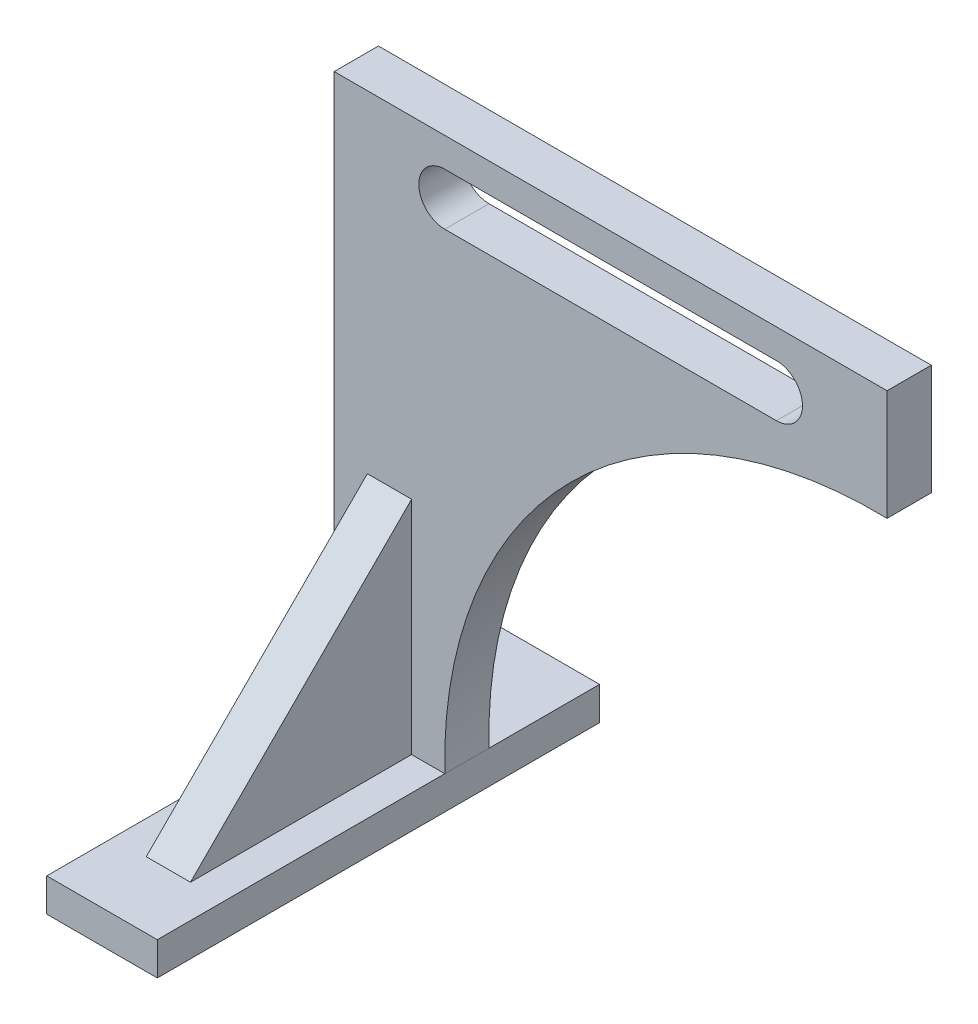
ISO-10303-21;
HEADER;
FILE_DESCRIPTION(('STEP AP214'),'2;1');
FILE_NAME('part.step','',(''),(''),'','','');
FILE_SCHEMA(('AUTOMOTIVE_DESIGN { 1 0 10303 214 1 1 1 1 }'));
ENDSEC;
DATA;
#1=APPLICATION_CONTEXT('core data for automotive mechanical design processes');
#2=APPLICATION_PROTOCOL_DEFINITION('international standard','automotive_design',2000,#1);
#3=PRODUCT_CONTEXT('',#1,'mechanical');
#4=PRODUCT('Part','Part','',(#3));
#5=PRODUCT_RELATED_PRODUCT_CATEGORY('part','',(#4));
#6=PRODUCT_DEFINITION_FORMATION('','',#4);
#7=PRODUCT_DEFINITION_CONTEXT('part definition',#1,'design');
#8=PRODUCT_DEFINITION('design','',#6,#7);
#9=PRODUCT_DEFINITION_SHAPE('','',#8);
#10=(LENGTH_UNIT() NAMED_UNIT(*) SI_UNIT(.MILLI.,.METRE.));
#11=(NAMED_UNIT(*) PLANE_ANGLE_UNIT() SI_UNIT($,.RADIAN.));
#12=(NAMED_UNIT(*) SI_UNIT($,.STERADIAN.) SOLID_ANGLE_UNIT());
#13=UNCERTAINTY_MEASURE_WITH_UNIT(LENGTH_MEASURE(1.E-05),#10,'distance_accuracy_value','');
#14=(GEOMETRIC_REPRESENTATION_CONTEXT(3) GLOBAL_UNCERTAINTY_ASSIGNED_CONTEXT((#13)) GLOBAL_UNIT_ASSIGNED_CONTEXT((#10,
#11,#12)) REPRESENTATION_CONTEXT('',''));
#15=CARTESIAN_POINT('',(0.,0.,0.));
#16=DIRECTION('',(0.,0.,1.));
#17=DIRECTION('',(1.,0.,0.));
#18=AXIS2_PLACEMENT_3D('',#15,#16,#17);
#19=CARTESIAN_POINT('',(0.,15.,0.));
#20=DIRECTION('',(0.,1.,0.));
#21=DIRECTION('',(0.,0.,1.));
#22=AXIS2_PLACEMENT_3D('',#19,#20,#21);
#23=PLANE('',#22);
#24=DIRECTION('',(0.,0.,1.));
#25=VECTOR('',#24,1.);
#26=CARTESIAN_POINT('',(-25.,15.,-100.));
#27=LINE('',#26,#25);
#28=CARTESIAN_POINT('',(-25.,15.,-100.));
#29=VERTEX_POINT('',#28);
#30=CARTESIAN_POINT('',(-25.,15.,-50.));
#31=VERTEX_POINT('',#30);
#32=EDGE_CURVE('E229',#29,#31,#27,.T.);
#33=ORIENTED_EDGE('',*,*,#32,.T.);
#34=DIRECTION('',(1.,0.,0.));
#35=VECTOR('',#34,1.);
#36=CARTESIAN_POINT('',(-25.,15.,-50.));
#37=LINE('',#36,#35);
#38=CARTESIAN_POINT('',(25.,15.,-50.));
#39=VERTEX_POINT('',#38);
#40=EDGE_CURVE('E194',#31,#39,#37,.T.);
#41=ORIENTED_EDGE('',*,*,#40,.T.);
#42=DIRECTION('',(0.,0.,1.));
#43=VECTOR('',#42,1.);
#44=CARTESIAN_POINT('',(25.,15.,-100.));
#45=LINE('',#44,#43);
#46=CARTESIAN_POINT('',(25.,15.,-100.));
#47=VERTEX_POINT('',#46);
#48=EDGE_CURVE('E237',#47,#39,#45,.T.);
#49=ORIENTED_EDGE('',*,*,#48,.F.);
#50=DIRECTION('',(1.,0.,0.));
#51=VECTOR('',#50,1.);
#52=CARTESIAN_POINT('',(-25.,15.,-100.));
#53=LINE('',#52,#51);
#54=EDGE_CURVE('E240',#29,#47,#53,.T.);
#55=ORIENTED_EDGE('',*,*,#54,.F.);
#56=EDGE_LOOP('',(#33,#41,#49,#55));
#57=FACE_BOUND('',#56,.T.);
#58=ADVANCED_FACE('F32',(#57),#23,.T.);
#59=CARTESIAN_POINT('',(-25.,15.,-100.));
#60=DIRECTION('',(1.,0.,0.));
#61=DIRECTION('',(0.,0.,-1.));
#62=AXIS2_PLACEMENT_3D('',#59,#60,#61);
#63=PLANE('',#62);
#64=DIRECTION('',(0.,0.,1.));
#65=VECTOR('',#64,1.);
#66=CARTESIAN_POINT('',(-25.,0.,-100.));
#67=LINE('',#66,#65);
#68=CARTESIAN_POINT('',(-25.,0.,-100.));
#69=VERTEX_POINT('',#68);
#70=CARTESIAN_POINT('',(-25.,0.,100.));
#71=VERTEX_POINT('',#70);
#72=EDGE_CURVE('E228',#69,#71,#67,.T.);
#73=ORIENTED_EDGE('',*,*,#72,.T.);
#74=DIRECTION('',(0.,-1.,0.));
#75=VECTOR('',#74,1.);
#76=CARTESIAN_POINT('',(-25.,15.,100.));
#77=LINE('',#76,#75);
#78=CARTESIAN_POINT('',(-25.,15.,100.));
#79=VERTEX_POINT('',#78);
#80=EDGE_CURVE('E260',#79,#71,#77,.T.);
#81=ORIENTED_EDGE('',*,*,#80,.F.);
#82=CARTESIAN_POINT('',(-25.,15.,-30.));
#83=VERTEX_POINT('',#82);
#84=EDGE_CURVE('E233',#83,#79,#27,.T.);
#85=ORIENTED_EDGE('',*,*,#84,.F.);
#86=DIRECTION('',(0.,-1.,0.));
#87=VECTOR('',#86,1.);
#88=CARTESIAN_POINT('',(-25.,15.,-30.));
#89=LINE('',#88,#87);
#90=CARTESIAN_POINT('',(-25.,265.,-30.));
#91=VERTEX_POINT('',#90);
#92=EDGE_CURVE('E205',#91,#83,#89,.T.);
#93=ORIENTED_EDGE('',*,*,#92,.F.);
#94=DIRECTION('',(0.,0.,-1.));
#95=VECTOR('',#94,1.);
#96=CARTESIAN_POINT('',(-25.,265.,-30.));
#97=LINE('',#96,#95);
#98=CARTESIAN_POINT('',(-25.,265.,-50.));
#99=VERTEX_POINT('',#98);
#100=EDGE_CURVE('E207',#91,#99,#97,.T.);
#101=ORIENTED_EDGE('',*,*,#100,.T.);
#102=DIRECTION('',(0.,-1.,0.));
#103=VECTOR('',#102,1.);
#104=CARTESIAN_POINT('',(-25.,15.,-50.));
#105=LINE('',#104,#103);
#106=EDGE_CURVE('E216',#99,#31,#105,.T.);
#107=ORIENTED_EDGE('',*,*,#106,.T.);
#108=ORIENTED_EDGE('',*,*,#32,.F.);
#109=DIRECTION('',(0.,-1.,0.));
#110=VECTOR('',#109,1.);
#111=CARTESIAN_POINT('',(-25.,15.,-100.));
#112=LINE('',#111,#110);
#113=EDGE_CURVE('E243',#29,#69,#112,.T.);
#114=ORIENTED_EDGE('',*,*,#113,.T.);
#115=EDGE_LOOP('',(#73,#81,#85,#93,#101,#107,#108,#114));
#116=FACE_BOUND('',#115,.T.);
#117=ADVANCED_FACE('F34',(#116),#63,.F.);
#118=CARTESIAN_POINT('',(-25.,15.,100.));
#119=DIRECTION('',(0.,0.,-1.));
#120=DIRECTION('',(-1.,0.,0.));
#121=AXIS2_PLACEMENT_3D('',#118,#119,#120);
#122=PLANE('',#121);
#123=DIRECTION('',(1.,0.,0.));
#124=VECTOR('',#123,1.);
#125=CARTESIAN_POINT('',(-25.,0.,100.));
#126=LINE('',#125,#124);
#127=CARTESIAN_POINT('',(25.,0.,100.));
#128=VERTEX_POINT('',#127);
#129=EDGE_CURVE('E246',#71,#128,#126,.T.);
#130=ORIENTED_EDGE('',*,*,#129,.T.);
#131=DIRECTION('',(0.,-1.,0.));
#132=VECTOR('',#131,1.);
#133=CARTESIAN_POINT('',(25.,15.,100.));
#134=LINE('',#133,#132);
#135=CARTESIAN_POINT('',(25.,15.,100.));
#136=VERTEX_POINT('',#135);
#137=EDGE_CURVE('E258',#136,#128,#134,.T.);
#138=ORIENTED_EDGE('',*,*,#137,.F.);
#139=DIRECTION('',(1.,0.,0.));
#140=VECTOR('',#139,1.);
#141=CARTESIAN_POINT('',(-25.,15.,100.));
#142=LINE('',#141,#140);
#143=EDGE_CURVE('E232',#79,#136,#142,.T.);
#144=ORIENTED_EDGE('',*,*,#143,.F.);
#145=ORIENTED_EDGE('',*,*,#80,.T.);
#146=EDGE_LOOP('',(#130,#138,#144,#145));
#147=FACE_BOUND('',#146,.T.);
#148=ADVANCED_FACE('F293',(#147),#122,.F.);
#149=CARTESIAN_POINT('',(25.,15.,-100.));
#150=DIRECTION('',(1.,0.,0.));
#151=DIRECTION('',(0.,0.,-1.));
#152=AXIS2_PLACEMENT_3D('',#149,#150,#151);
#153=PLANE('',#152);
#154=DIRECTION('',(0.,0.,1.));
#155=VECTOR('',#154,1.);
#156=CARTESIAN_POINT('',(25.,0.,-100.));
#157=LINE('',#156,#155);
#158=CARTESIAN_POINT('',(25.,0.,-100.));
#159=VERTEX_POINT('',#158);
#160=EDGE_CURVE('E249',#159,#128,#157,.T.);
#161=ORIENTED_EDGE('',*,*,#160,.F.);
#162=DIRECTION('',(0.,-1.,0.));
#163=VECTOR('',#162,1.);
#164=CARTESIAN_POINT('',(25.,15.,-100.));
#165=LINE('',#164,#163);
#166=EDGE_CURVE('E256',#47,#159,#165,.T.);
#167=ORIENTED_EDGE('',*,*,#166,.F.);
#168=ORIENTED_EDGE('',*,*,#48,.T.);
#169=DIRECTION('',(0.,0.,-1.));
#170=VECTOR('',#169,1.);
#171=CARTESIAN_POINT('',(25.,15.,-30.));
#172=LINE('',#171,#170);
#173=CARTESIAN_POINT('',(25.,15.,-30.));
#174=VERTEX_POINT('',#173);
#175=EDGE_CURVE('E226',#174,#39,#172,.T.);
#176=ORIENTED_EDGE('',*,*,#175,.F.);
#177=EDGE_CURVE('E236',#174,#136,#45,.T.);
#178=ORIENTED_EDGE('',*,*,#177,.T.);
#179=ORIENTED_EDGE('',*,*,#137,.T.);
#180=EDGE_LOOP('',(#161,#167,#168,#176,#178,#179));
#181=FACE_BOUND('',#180,.T.);
#182=ADVANCED_FACE('F307',(#181),#153,.T.);
#183=CARTESIAN_POINT('',(-25.,15.,-100.));
#184=DIRECTION('',(0.,0.,-1.));
#185=DIRECTION('',(-1.,0.,0.));
#186=AXIS2_PLACEMENT_3D('',#183,#184,#185);
#187=PLANE('',#186);
#188=DIRECTION('',(1.,0.,0.));
#189=VECTOR('',#188,1.);
#190=CARTESIAN_POINT('',(-25.,0.,-100.));
#191=LINE('',#190,#189);
#192=EDGE_CURVE('E252',#69,#159,#191,.T.);
#193=ORIENTED_EDGE('',*,*,#192,.F.);
#194=ORIENTED_EDGE('',*,*,#113,.F.);
#195=ORIENTED_EDGE('',*,*,#54,.T.);
#196=ORIENTED_EDGE('',*,*,#166,.T.);
#197=EDGE_LOOP('',(#193,#194,#195,#196));
#198=FACE_BOUND('',#197,.T.);
#199=ADVANCED_FACE('F299',(#198),#187,.T.);
#200=DIRECTION('',(0.,0.,-1.));
#201=VECTOR('',#200,1.);
#202=CARTESIAN_POINT('',(10.,15.,70.));
#203=LINE('',#202,#201);
#204=CARTESIAN_POINT('',(10.,15.,70.));
#205=VERTEX_POINT('',#204);
#206=CARTESIAN_POINT('',(10.,15.,-30.));
#207=VERTEX_POINT('',#206);
#208=EDGE_CURVE('E176',#205,#207,#203,.T.);
#209=ORIENTED_EDGE('',*,*,#208,.F.);
#210=DIRECTION('',(-1.,0.,0.));
#211=VECTOR('',#210,1.);
#212=CARTESIAN_POINT('',(10.,15.,70.));
#213=LINE('',#212,#211);
#214=CARTESIAN_POINT('',(-10.,15.,70.));
#215=VERTEX_POINT('',#214);
#216=EDGE_CURVE('E191',#205,#215,#213,.T.);
#217=ORIENTED_EDGE('',*,*,#216,.T.);
#218=DIRECTION('',(0.,0.,-1.));
#219=VECTOR('',#218,1.);
#220=CARTESIAN_POINT('',(-10.,15.,70.));
#221=LINE('',#220,#219);
#222=CARTESIAN_POINT('',(-10.,15.,-30.));
#223=VERTEX_POINT('',#222);
#224=EDGE_CURVE('E184',#215,#223,#221,.T.);
#225=ORIENTED_EDGE('',*,*,#224,.T.);
#226=DIRECTION('',(1.,0.,0.));
#227=VECTOR('',#226,1.);
#228=CARTESIAN_POINT('',(-25.,15.,-30.));
#229=LINE('',#228,#227);
#230=EDGE_CURVE('E195',#83,#223,#229,.T.);
#231=ORIENTED_EDGE('',*,*,#230,.F.);
#232=ORIENTED_EDGE('',*,*,#84,.T.);
#233=ORIENTED_EDGE('',*,*,#143,.T.);
#234=ORIENTED_EDGE('',*,*,#177,.F.);
#235=EDGE_CURVE('E199',#207,#174,#229,.T.);
#236=ORIENTED_EDGE('',*,*,#235,.F.);
#237=EDGE_LOOP('',(#209,#217,#225,#231,#232,#233,#234,#236));
#238=FACE_BOUND('',#237,.T.);
#239=ADVANCED_FACE('F289',(#238),#23,.T.);
#240=CARTESIAN_POINT('',(0.,0.,0.));
#241=DIRECTION('',(0.,1.,0.));
#242=DIRECTION('',(0.,0.,1.));
#243=AXIS2_PLACEMENT_3D('',#240,#241,#242);
#244=PLANE('',#243);
#245=ORIENTED_EDGE('',*,*,#72,.F.);
#246=ORIENTED_EDGE('',*,*,#192,.T.);
#247=ORIENTED_EDGE('',*,*,#160,.T.);
#248=ORIENTED_EDGE('',*,*,#129,.F.);
#249=EDGE_LOOP('',(#245,#246,#247,#248));
#250=FACE_BOUND('',#249,.T.);
#251=ADVANCED_FACE('F298',(#250),#244,.F.);
#252=CARTESIAN_POINT('',(220.242033787609,19.7579662123913,-30.));
#253=DIRECTION('',(0.,0.,-1.));
#254=DIRECTION('',(-1.,0.,0.));
#255=AXIS2_PLACEMENT_3D('',#252,#253,#254);
#256=CYLINDRICAL_SURFACE('',#255,195.3);
#257=CARTESIAN_POINT('',(220.242033787609,19.7579662123913,-50.));
#258=DIRECTION('',(0.,0.,-1.));
#259=DIRECTION('',(1.,0.,0.));
#260=AXIS2_PLACEMENT_3D('',#257,#258,#259);
#261=CIRCLE('',#260,195.3);
#262=CARTESIAN_POINT('',(225.,215.,-50.));
#263=VERTEX_POINT('',#262);
#264=EDGE_CURVE('E210',#39,#263,#261,.T.);
#265=ORIENTED_EDGE('',*,*,#264,.T.);
#266=DIRECTION('',(0.,0.,-1.));
#267=VECTOR('',#266,1.);
#268=CARTESIAN_POINT('',(225.,215.,-30.));
#269=LINE('',#268,#267);
#270=CARTESIAN_POINT('',(225.,215.,-30.));
#271=VERTEX_POINT('',#270);
#272=EDGE_CURVE('E223',#271,#263,#269,.T.);
#273=ORIENTED_EDGE('',*,*,#272,.F.);
#274=CARTESIAN_POINT('',(220.242033787609,19.7579662123913,-30.));
#275=DIRECTION('',(0.,0.,-1.));
#276=DIRECTION('',(1.,0.,0.));
#277=AXIS2_PLACEMENT_3D('',#274,#275,#276);
#278=CIRCLE('',#277,195.3);
#279=EDGE_CURVE('E198',#174,#271,#278,.T.);
#280=ORIENTED_EDGE('',*,*,#279,.F.);
#281=ORIENTED_EDGE('',*,*,#175,.T.);
#282=EDGE_LOOP('',(#265,#273,#280,#281));
#283=FACE_BOUND('',#282,.T.);
#284=ADVANCED_FACE('F305',(#283),#256,.F.);
#285=CARTESIAN_POINT('',(225.,265.,-30.));
#286=DIRECTION('',(-1.,0.,0.));
#287=DIRECTION('',(0.,-1.,0.));
#288=AXIS2_PLACEMENT_3D('',#285,#286,#287);
#289=PLANE('',#288);
#290=DIRECTION('',(0.,1.,0.));
#291=VECTOR('',#290,1.);
#292=CARTESIAN_POINT('',(225.,265.,-50.));
#293=LINE('',#292,#291);
#294=CARTESIAN_POINT('',(225.,265.,-50.));
#295=VERTEX_POINT('',#294);
#296=EDGE_CURVE('E212',#263,#295,#293,.T.);
#297=ORIENTED_EDGE('',*,*,#296,.T.);
#298=DIRECTION('',(0.,0.,-1.));
#299=VECTOR('',#298,1.);
#300=CARTESIAN_POINT('',(225.,265.,-30.));
#301=LINE('',#300,#299);
#302=CARTESIAN_POINT('',(225.,265.,-30.));
#303=VERTEX_POINT('',#302);
#304=EDGE_CURVE('E220',#303,#295,#301,.T.);
#305=ORIENTED_EDGE('',*,*,#304,.F.);
#306=DIRECTION('',(0.,1.,0.));
#307=VECTOR('',#306,1.);
#308=CARTESIAN_POINT('',(225.,265.,-30.));
#309=LINE('',#308,#307);
#310=EDGE_CURVE('E201',#271,#303,#309,.T.);
#311=ORIENTED_EDGE('',*,*,#310,.F.);
#312=ORIENTED_EDGE('',*,*,#272,.T.);
#313=EDGE_LOOP('',(#297,#305,#311,#312));
#314=FACE_BOUND('',#313,.T.);
#315=ADVANCED_FACE('F349',(#314),#289,.F.);
#316=CARTESIAN_POINT('',(-25.,265.,-30.));
#317=DIRECTION('',(0.,-1.,0.));
#318=DIRECTION('',(0.,0.,-1.));
#319=AXIS2_PLACEMENT_3D('',#316,#317,#318);
#320=PLANE('',#319);
#321=DIRECTION('',(-1.,0.,0.));
#322=VECTOR('',#321,1.);
#323=CARTESIAN_POINT('',(-25.,265.,-50.));
#324=LINE('',#323,#322);
#325=EDGE_CURVE('E214',#295,#99,#324,.T.);
#326=ORIENTED_EDGE('',*,*,#325,.T.);
#327=ORIENTED_EDGE('',*,*,#100,.F.);
#328=DIRECTION('',(-1.,0.,0.));
#329=VECTOR('',#328,1.);
#330=CARTESIAN_POINT('',(-25.,265.,-30.));
#331=LINE('',#330,#329);
#332=EDGE_CURVE('E203',#303,#91,#331,.T.);
#333=ORIENTED_EDGE('',*,*,#332,.F.);
#334=ORIENTED_EDGE('',*,*,#304,.T.);
#335=EDGE_LOOP('',(#326,#327,#333,#334));
#336=FACE_BOUND('',#335,.T.);
#337=ADVANCED_FACE('F345',(#336),#320,.F.);
#338=CARTESIAN_POINT('',(220.242033787609,19.7579662123913,-30.));
#339=DIRECTION('',(0.,0.,1.));
#340=DIRECTION('',(1.,0.,0.));
#341=AXIS2_PLACEMENT_3D('',#338,#339,#340);
#342=PLANE('',#341);
#343=CARTESIAN_POINT('',(25.,240.,-30.));
#344=DIRECTION('',(0.,0.,1.));
#345=DIRECTION('',(1.,0.,0.));
#346=AXIS2_PLACEMENT_3D('',#343,#344,#345);
#347=CIRCLE('',#346,11.75);
#348=CARTESIAN_POINT('',(25.,251.75,-30.));
#349=VERTEX_POINT('',#348);
#350=CARTESIAN_POINT('',(25.,228.25,-30.));
#351=VERTEX_POINT('',#350);
#352=EDGE_CURVE('E47',#349,#351,#347,.T.);
#353=ORIENTED_EDGE('',*,*,#352,.F.);
#354=DIRECTION('',(-1.,0.,0.));
#355=VECTOR('',#354,1.);
#356=CARTESIAN_POINT('',(25.,251.75,-30.));
#357=LINE('',#356,#355);
#358=CARTESIAN_POINT('',(175.,251.75,-30.));
#359=VERTEX_POINT('',#358);
#360=EDGE_CURVE('E164',#359,#349,#357,.T.);
#361=ORIENTED_EDGE('',*,*,#360,.F.);
#362=CARTESIAN_POINT('',(175.,240.,-30.));
#363=DIRECTION('',(0.,0.,1.));
#364=DIRECTION('',(1.,0.,0.));
#365=AXIS2_PLACEMENT_3D('',#362,#363,#364);
#366=CIRCLE('',#365,11.75);
#367=CARTESIAN_POINT('',(175.,228.25,-30.));
#368=VERTEX_POINT('',#367);
#369=EDGE_CURVE('E148',#368,#359,#366,.T.);
#370=ORIENTED_EDGE('',*,*,#369,.F.);
#371=DIRECTION('',(1.,0.,0.));
#372=VECTOR('',#371,1.);
#373=CARTESIAN_POINT('',(25.,228.25,-30.));
#374=LINE('',#373,#372);
#375=EDGE_CURVE('E157',#351,#368,#374,.T.);
#376=ORIENTED_EDGE('',*,*,#375,.F.);
#377=EDGE_LOOP('',(#353,#361,#370,#376));
#378=FACE_BOUND('',#377,.T.);
#379=DIRECTION('',(0.,1.,0.));
#380=VECTOR('',#379,1.);
#381=CARTESIAN_POINT('',(10.,15.,-30.));
#382=LINE('',#381,#380);
#383=CARTESIAN_POINT('',(10.,115.,-30.));
#384=VERTEX_POINT('',#383);
#385=EDGE_CURVE('E179',#207,#384,#382,.T.);
#386=ORIENTED_EDGE('',*,*,#385,.F.);
#387=ORIENTED_EDGE('',*,*,#235,.T.);
#388=ORIENTED_EDGE('',*,*,#279,.T.);
#389=ORIENTED_EDGE('',*,*,#310,.T.);
#390=ORIENTED_EDGE('',*,*,#332,.T.);
#391=ORIENTED_EDGE('',*,*,#92,.T.);
#392=ORIENTED_EDGE('',*,*,#230,.T.);
#393=DIRECTION('',(0.,1.,0.));
#394=VECTOR('',#393,1.);
#395=CARTESIAN_POINT('',(-10.,15.,-30.));
#396=LINE('',#395,#394);
#397=CARTESIAN_POINT('',(-10.,115.,-30.));
#398=VERTEX_POINT('',#397);
#399=EDGE_CURVE('E177',#223,#398,#396,.T.);
#400=ORIENTED_EDGE('',*,*,#399,.T.);
#401=DIRECTION('',(-1.,0.,0.));
#402=VECTOR('',#401,1.);
#403=CARTESIAN_POINT('',(10.,115.,-30.));
#404=LINE('',#403,#402);
#405=EDGE_CURVE('E181',#384,#398,#404,.T.);
#406=ORIENTED_EDGE('',*,*,#405,.F.);
#407=EDGE_LOOP('',(#386,#387,#388,#389,#390,#391,#392,#400,#406));
#408=FACE_BOUND('',#407,.T.);
#409=ADVANCED_FACE('F161',(#378,#408),#342,.T.);
#410=CARTESIAN_POINT('',(220.242033787609,19.7579662123913,-50.));
#411=DIRECTION('',(0.,0.,1.));
#412=DIRECTION('',(1.,0.,0.));
#413=AXIS2_PLACEMENT_3D('',#410,#411,#412);
#414=PLANE('',#413);
#415=DIRECTION('',(-1.,0.,0.));
#416=VECTOR('',#415,1.);
#417=CARTESIAN_POINT('',(220.242033787609,251.75,-50.));
#418=LINE('',#417,#416);
#419=CARTESIAN_POINT('',(175.,251.75,-50.));
#420=VERTEX_POINT('',#419);
#421=CARTESIAN_POINT('',(25.,251.75,-50.));
#422=VERTEX_POINT('',#421);
#423=EDGE_CURVE('E40',#420,#422,#418,.T.);
#424=ORIENTED_EDGE('',*,*,#423,.T.);
#425=CARTESIAN_POINT('',(25.,240.,-50.));
#426=DIRECTION('',(0.,0.,1.));
#427=DIRECTION('',(1.,0.,0.));
#428=AXIS2_PLACEMENT_3D('',#425,#426,#427);
#429=CIRCLE('',#428,11.75);
#430=CARTESIAN_POINT('',(25.,228.25,-50.));
#431=VERTEX_POINT('',#430);
#432=EDGE_CURVE('E11',#422,#431,#429,.T.);
#433=ORIENTED_EDGE('',*,*,#432,.T.);
#434=DIRECTION('',(1.,0.,0.));
#435=VECTOR('',#434,1.);
#436=CARTESIAN_POINT('',(220.242033787609,228.25,-50.));
#437=LINE('',#436,#435);
#438=CARTESIAN_POINT('',(175.,228.25,-50.));
#439=VERTEX_POINT('',#438);
#440=EDGE_CURVE('E263',#431,#439,#437,.T.);
#441=ORIENTED_EDGE('',*,*,#440,.T.);
#442=CARTESIAN_POINT('',(175.,240.,-50.));
#443=DIRECTION('',(0.,0.,1.));
#444=DIRECTION('',(1.,0.,0.));
#445=AXIS2_PLACEMENT_3D('',#442,#443,#444);
#446=CIRCLE('',#445,11.75);
#447=EDGE_CURVE('E151',#439,#420,#446,.T.);
#448=ORIENTED_EDGE('',*,*,#447,.T.);
#449=EDGE_LOOP('',(#424,#433,#441,#448));
#450=FACE_BOUND('',#449,.T.);
#451=ORIENTED_EDGE('',*,*,#40,.F.);
#452=ORIENTED_EDGE('',*,*,#106,.F.);
#453=ORIENTED_EDGE('',*,*,#325,.F.);
#454=ORIENTED_EDGE('',*,*,#296,.F.);
#455=ORIENTED_EDGE('',*,*,#264,.F.);
#456=EDGE_LOOP('',(#451,#452,#453,#454,#455));
#457=FACE_BOUND('',#456,.T.);
#458=ADVANCED_FACE('F267',(#450,#457),#414,.F.);
#459=CARTESIAN_POINT('',(10.,115.,-30.));
#460=DIRECTION('',(0.,-0.707106781186547,-0.707106781186548));
#461=DIRECTION('',(0.,0.707106781186548,-0.707106781186547));
#462=AXIS2_PLACEMENT_3D('',#459,#460,#461);
#463=PLANE('',#462);
#464=DIRECTION('',(0.,-0.707106781186548,0.707106781186547));
#465=VECTOR('',#464,1.);
#466=CARTESIAN_POINT('',(-10.,115.,-30.));
#467=LINE('',#466,#465);
#468=EDGE_CURVE('E171',#398,#215,#467,.T.);
#469=ORIENTED_EDGE('',*,*,#468,.T.);
#470=ORIENTED_EDGE('',*,*,#216,.F.);
#471=DIRECTION('',(0.,-0.707106781186548,0.707106781186547));
#472=VECTOR('',#471,1.);
#473=CARTESIAN_POINT('',(10.,115.,-30.));
#474=LINE('',#473,#472);
#475=EDGE_CURVE('E174',#384,#205,#474,.T.);
#476=ORIENTED_EDGE('',*,*,#475,.F.);
#477=ORIENTED_EDGE('',*,*,#405,.T.);
#478=EDGE_LOOP('',(#469,#470,#476,#477));
#479=FACE_BOUND('',#478,.T.);
#480=ADVANCED_FACE('F320',(#479),#463,.F.);
#481=CARTESIAN_POINT('',(10.,0.,0.));
#482=DIRECTION('',(1.,0.,0.));
#483=DIRECTION('',(0.,0.,-1.));
#484=AXIS2_PLACEMENT_3D('',#481,#482,#483);
#485=PLANE('',#484);
#486=ORIENTED_EDGE('',*,*,#475,.T.);
#487=ORIENTED_EDGE('',*,*,#208,.T.);
#488=ORIENTED_EDGE('',*,*,#385,.T.);
#489=EDGE_LOOP('',(#486,#487,#488));
#490=FACE_BOUND('',#489,.T.);
#491=ADVANCED_FACE('F281',(#490),#485,.T.);
#492=CARTESIAN_POINT('',(-10.,0.,0.));
#493=DIRECTION('',(1.,0.,0.));
#494=DIRECTION('',(0.,0.,-1.));
#495=AXIS2_PLACEMENT_3D('',#492,#493,#494);
#496=PLANE('',#495);
#497=ORIENTED_EDGE('',*,*,#468,.F.);
#498=ORIENTED_EDGE('',*,*,#399,.F.);
#499=ORIENTED_EDGE('',*,*,#224,.F.);
#500=EDGE_LOOP('',(#497,#498,#499));
#501=FACE_BOUND('',#500,.T.);
#502=ADVANCED_FACE('F274',(#501),#496,.F.);
#503=CARTESIAN_POINT('',(25.,240.,-100.));
#504=DIRECTION('',(0.,0.,1.));
#505=DIRECTION('',(1.,0.,0.));
#506=AXIS2_PLACEMENT_3D('',#503,#504,#505);
#507=CYLINDRICAL_SURFACE('',#506,11.75);
#508=DIRECTION('',(0.,0.,1.));
#509=VECTOR('',#508,1.);
#510=CARTESIAN_POINT('',(25.,251.75,-100.));
#511=LINE('',#510,#509);
#512=EDGE_CURVE('E169',#422,#349,#511,.T.);
#513=ORIENTED_EDGE('',*,*,#512,.T.);
#514=ORIENTED_EDGE('',*,*,#352,.T.);
#515=DIRECTION('',(0.,0.,1.));
#516=VECTOR('',#515,1.);
#517=CARTESIAN_POINT('',(25.,228.25,-100.));
#518=LINE('',#517,#516);
#519=EDGE_CURVE('E154',#431,#351,#518,.T.);
#520=ORIENTED_EDGE('',*,*,#519,.F.);
#521=ORIENTED_EDGE('',*,*,#432,.F.);
#522=EDGE_LOOP('',(#513,#514,#520,#521));
#523=FACE_BOUND('',#522,.T.);
#524=ADVANCED_FACE('F272',(#523),#507,.F.);
#525=CARTESIAN_POINT('',(25.,251.75,-100.));
#526=DIRECTION('',(0.,1.,0.));
#527=DIRECTION('',(0.,0.,1.));
#528=AXIS2_PLACEMENT_3D('',#525,#526,#527);
#529=PLANE('',#528);
#530=DIRECTION('',(0.,0.,1.));
#531=VECTOR('',#530,1.);
#532=CARTESIAN_POINT('',(175.,251.75,-100.));
#533=LINE('',#532,#531);
#534=EDGE_CURVE('E153',#420,#359,#533,.T.);
#535=ORIENTED_EDGE('',*,*,#534,.T.);
#536=ORIENTED_EDGE('',*,*,#360,.T.);
#537=ORIENTED_EDGE('',*,*,#512,.F.);
#538=ORIENTED_EDGE('',*,*,#423,.F.);
#539=EDGE_LOOP('',(#535,#536,#537,#538));
#540=FACE_BOUND('',#539,.T.);
#541=ADVANCED_FACE('F271',(#540),#529,.F.);
#542=CARTESIAN_POINT('',(175.,240.,-100.));
#543=DIRECTION('',(0.,0.,1.));
#544=DIRECTION('',(1.,0.,0.));
#545=AXIS2_PLACEMENT_3D('',#542,#543,#544);
#546=CYLINDRICAL_SURFACE('',#545,11.75);
#547=DIRECTION('',(0.,0.,1.));
#548=VECTOR('',#547,1.);
#549=CARTESIAN_POINT('',(175.,228.25,-100.));
#550=LINE('',#549,#548);
#551=EDGE_CURVE('E55',#439,#368,#550,.T.);
#552=ORIENTED_EDGE('',*,*,#551,.T.);
#553=ORIENTED_EDGE('',*,*,#369,.T.);
#554=ORIENTED_EDGE('',*,*,#534,.F.);
#555=ORIENTED_EDGE('',*,*,#447,.F.);
#556=EDGE_LOOP('',(#552,#553,#554,#555));
#557=FACE_BOUND('',#556,.T.);
#558=ADVANCED_FACE('F145',(#557),#546,.F.);
#559=CARTESIAN_POINT('',(25.,228.25,-100.));
#560=DIRECTION('',(0.,-1.,0.));
#561=DIRECTION('',(0.,0.,-1.));
#562=AXIS2_PLACEMENT_3D('',#559,#560,#561);
#563=PLANE('',#562);
#564=ORIENTED_EDGE('',*,*,#519,.T.);
#565=ORIENTED_EDGE('',*,*,#375,.T.);
#566=ORIENTED_EDGE('',*,*,#551,.F.);
#567=ORIENTED_EDGE('',*,*,#440,.F.);
#568=EDGE_LOOP('',(#564,#565,#566,#567));
#569=FACE_BOUND('',#568,.T.);
#570=ADVANCED_FACE('F158',(#569),#563,.F.);
#571=CLOSED_SHELL('',(#58,#117,#148,#182,#199,#239,#251,#284,#315,#337,#409,#458,#480,#491,#502,
#524,#541,#558,#570));
#572=MANIFOLD_SOLID_BREP('B2',#571);
#573=ADVANCED_BREP_SHAPE_REPRESENTATION('',(#18,#572),#14);
#574=SHAPE_DEFINITION_REPRESENTATION(#9,#573);
ENDSEC;
END-ISO-10303-21;
